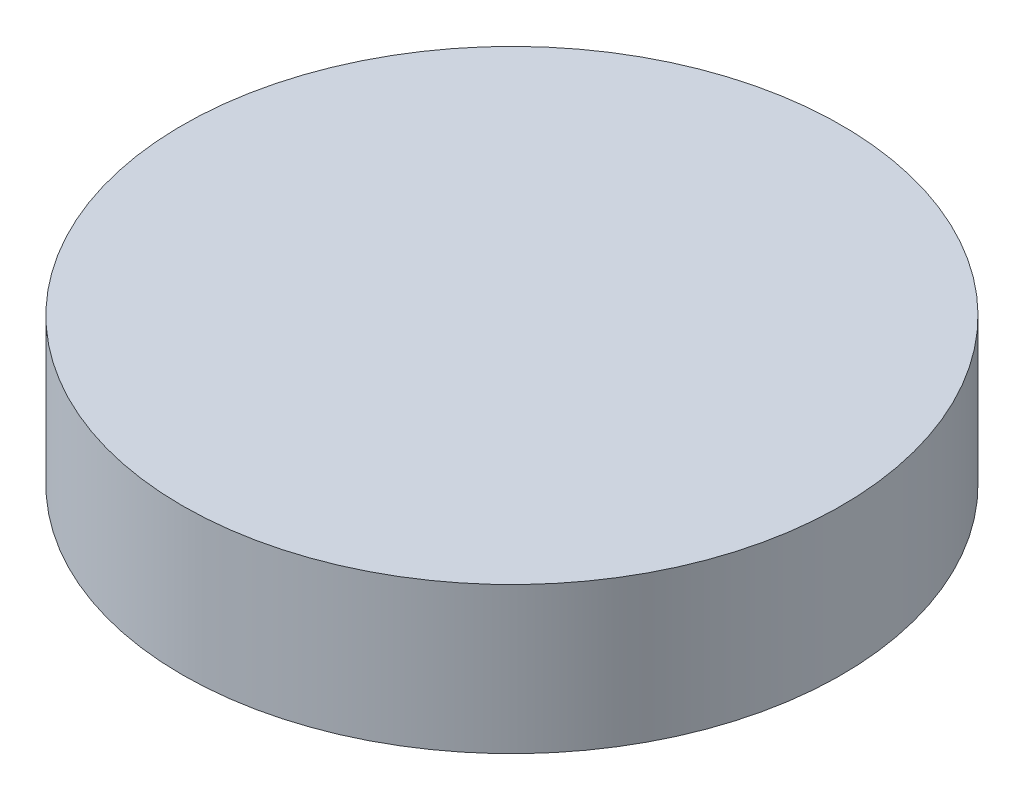
ISO-10303-21;
HEADER;
FILE_DESCRIPTION(('STEP AP214'),'2;1');
FILE_NAME('part.step','',(''),(''),'','','');
FILE_SCHEMA(('AUTOMOTIVE_DESIGN { 1 0 10303 214 1 1 1 1 }'));
ENDSEC;
DATA;
#1=APPLICATION_CONTEXT('core data for automotive mechanical design processes');
#2=APPLICATION_PROTOCOL_DEFINITION('international standard','automotive_design',2000,#1);
#3=PRODUCT_CONTEXT('',#1,'mechanical');
#4=PRODUCT('Part','Part','',(#3));
#5=PRODUCT_RELATED_PRODUCT_CATEGORY('part','',(#4));
#6=PRODUCT_DEFINITION_FORMATION('','',#4);
#7=PRODUCT_DEFINITION_CONTEXT('part definition',#1,'design');
#8=PRODUCT_DEFINITION('design','',#6,#7);
#9=PRODUCT_DEFINITION_SHAPE('','',#8);
#10=(LENGTH_UNIT() NAMED_UNIT(*) SI_UNIT(.MILLI.,.METRE.));
#11=(NAMED_UNIT(*) PLANE_ANGLE_UNIT() SI_UNIT($,.RADIAN.));
#12=(NAMED_UNIT(*) SI_UNIT($,.STERADIAN.) SOLID_ANGLE_UNIT());
#13=UNCERTAINTY_MEASURE_WITH_UNIT(LENGTH_MEASURE(1.E-05),#10,'distance_accuracy_value','');
#14=(GEOMETRIC_REPRESENTATION_CONTEXT(3) GLOBAL_UNCERTAINTY_ASSIGNED_CONTEXT((#13)) GLOBAL_UNIT_ASSIGNED_CONTEXT((#10,
#11,#12)) REPRESENTATION_CONTEXT('',''));
#15=CARTESIAN_POINT('',(0.,0.,0.));
#16=DIRECTION('',(0.,0.,1.));
#17=DIRECTION('',(1.,0.,0.));
#18=AXIS2_PLACEMENT_3D('',#15,#16,#17);
#19=CARTESIAN_POINT('',(0.,20.,0.));
#20=DIRECTION('',(0.,-1.,0.));
#21=DIRECTION('',(0.,0.,-1.));
#22=AXIS2_PLACEMENT_3D('',#19,#20,#21);
#23=CYLINDRICAL_SURFACE('',#22,45.);
#24=CARTESIAN_POINT('',(0.,20.,0.));
#25=DIRECTION('',(0.,1.,0.));
#26=DIRECTION('',(0.,0.,1.));
#27=AXIS2_PLACEMENT_3D('',#24,#25,#26);
#28=CIRCLE('',#27,45.);
#29=CARTESIAN_POINT('',(0.,20.,45.));
#30=VERTEX_POINT('',#29);
#31=EDGE_CURVE('E10',#30,#30,#28,.T.);
#32=ORIENTED_EDGE('',*,*,#31,.F.);
#33=EDGE_LOOP('',(#32));
#34=FACE_BOUND('',#33,.T.);
#35=CARTESIAN_POINT('',(0.,0.,0.));
#36=DIRECTION('',(0.,1.,0.));
#37=DIRECTION('',(0.,0.,1.));
#38=AXIS2_PLACEMENT_3D('',#35,#36,#37);
#39=CIRCLE('',#38,45.);
#40=CARTESIAN_POINT('',(0.,0.,45.));
#41=VERTEX_POINT('',#40);
#42=EDGE_CURVE('E33',#41,#41,#39,.T.);
#43=ORIENTED_EDGE('',*,*,#42,.T.);
#44=EDGE_LOOP('',(#43));
#45=FACE_BOUND('',#44,.T.);
#46=ADVANCED_FACE('F30',(#34,#45),#23,.T.);
#47=CARTESIAN_POINT('',(0.,20.,0.));
#48=DIRECTION('',(0.,1.,0.));
#49=DIRECTION('',(0.,0.,1.));
#50=AXIS2_PLACEMENT_3D('',#47,#48,#49);
#51=PLANE('',#50);
#52=ORIENTED_EDGE('',*,*,#31,.T.);
#53=EDGE_LOOP('',(#52));
#54=FACE_BOUND('',#53,.T.);
#55=ADVANCED_FACE('F45',(#54),#51,.T.);
#56=CARTESIAN_POINT('',(0.,0.,0.));
#57=DIRECTION('',(0.,1.,0.));
#58=DIRECTION('',(0.,0.,1.));
#59=AXIS2_PLACEMENT_3D('',#56,#57,#58);
#60=PLANE('',#59);
#61=ORIENTED_EDGE('',*,*,#42,.F.);
#62=EDGE_LOOP('',(#61));
#63=FACE_BOUND('',#62,.T.);
#64=ADVANCED_FACE('F43',(#63),#60,.F.);
#65=CLOSED_SHELL('',(#46,#55,#64));
#66=MANIFOLD_SOLID_BREP('B2',#65);
#67=ADVANCED_BREP_SHAPE_REPRESENTATION('',(#18,#66),#14);
#68=SHAPE_DEFINITION_REPRESENTATION(#9,#67);
ENDSEC;
END-ISO-10303-21;
